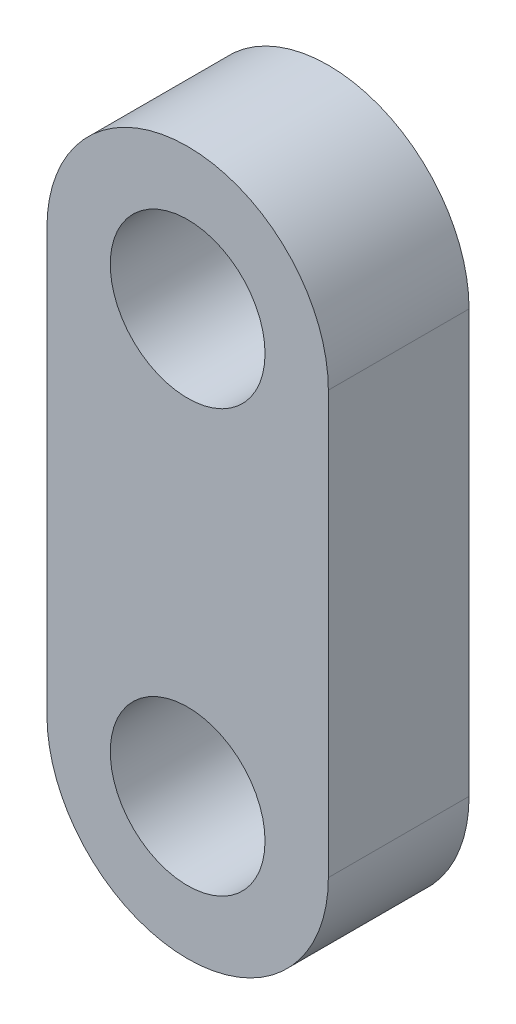
ISO-10303-21;
HEADER;
FILE_DESCRIPTION(('STEP AP214'),'2;1');
FILE_NAME('part.step','',(''),(''),'','','');
FILE_SCHEMA(('AUTOMOTIVE_DESIGN { 1 0 10303 214 1 1 1 1 }'));
ENDSEC;
DATA;
#1=APPLICATION_CONTEXT('core data for automotive mechanical design processes');
#2=APPLICATION_PROTOCOL_DEFINITION('international standard','automotive_design',2000,#1);
#3=PRODUCT_CONTEXT('',#1,'mechanical');
#4=PRODUCT('Part','Part','',(#3));
#5=PRODUCT_RELATED_PRODUCT_CATEGORY('part','',(#4));
#6=PRODUCT_DEFINITION_FORMATION('','',#4);
#7=PRODUCT_DEFINITION_CONTEXT('part definition',#1,'design');
#8=PRODUCT_DEFINITION('design','',#6,#7);
#9=PRODUCT_DEFINITION_SHAPE('','',#8);
#10=(LENGTH_UNIT() NAMED_UNIT(*) SI_UNIT(.MILLI.,.METRE.));
#11=(NAMED_UNIT(*) PLANE_ANGLE_UNIT() SI_UNIT($,.RADIAN.));
#12=(NAMED_UNIT(*) SI_UNIT($,.STERADIAN.) SOLID_ANGLE_UNIT());
#13=UNCERTAINTY_MEASURE_WITH_UNIT(LENGTH_MEASURE(1.E-05),#10,'distance_accuracy_value','');
#14=(GEOMETRIC_REPRESENTATION_CONTEXT(3) GLOBAL_UNCERTAINTY_ASSIGNED_CONTEXT((#13)) GLOBAL_UNIT_ASSIGNED_CONTEXT((#10,
#11,#12)) REPRESENTATION_CONTEXT('',''));
#15=CARTESIAN_POINT('',(0.,0.,0.));
#16=DIRECTION('',(0.,0.,1.));
#17=DIRECTION('',(1.,0.,0.));
#18=AXIS2_PLACEMENT_3D('',#15,#16,#17);
#19=CARTESIAN_POINT('',(0.,7.5,5.));
#20=DIRECTION('',(0.,0.,-1.));
#21=DIRECTION('',(-1.,0.,0.));
#22=AXIS2_PLACEMENT_3D('',#19,#20,#21);
#23=CYLINDRICAL_SURFACE('',#22,5.);
#24=CARTESIAN_POINT('',(0.,7.5,0.));
#25=DIRECTION('',(0.,0.,1.));
#26=DIRECTION('',(1.,0.,0.));
#27=AXIS2_PLACEMENT_3D('',#24,#25,#26);
#28=CIRCLE('',#27,5.);
#29=CARTESIAN_POINT('',(4.99999999999999,7.5,0.));
#30=VERTEX_POINT('',#29);
#31=CARTESIAN_POINT('',(-5.,7.49999999999999,0.));
#32=VERTEX_POINT('',#31);
#33=EDGE_CURVE('E104',#30,#32,#28,.T.);
#34=ORIENTED_EDGE('',*,*,#33,.T.);
#35=DIRECTION('',(0.,0.,-1.));
#36=VECTOR('',#35,1.);
#37=CARTESIAN_POINT('',(-5.,7.49999999999999,5.));
#38=LINE('',#37,#36);
#39=CARTESIAN_POINT('',(-5.,7.49999999999999,5.));
#40=VERTEX_POINT('',#39);
#41=EDGE_CURVE('E11',#40,#32,#38,.T.);
#42=ORIENTED_EDGE('',*,*,#41,.F.);
#43=CARTESIAN_POINT('',(0.,7.5,5.));
#44=DIRECTION('',(0.,0.,1.));
#45=DIRECTION('',(1.,0.,0.));
#46=AXIS2_PLACEMENT_3D('',#43,#44,#45);
#47=CIRCLE('',#46,5.);
#48=CARTESIAN_POINT('',(4.99999999999999,7.5,5.));
#49=VERTEX_POINT('',#48);
#50=EDGE_CURVE('E92',#49,#40,#47,.T.);
#51=ORIENTED_EDGE('',*,*,#50,.F.);
#52=DIRECTION('',(0.,0.,-1.));
#53=VECTOR('',#52,1.);
#54=CARTESIAN_POINT('',(4.99999999999999,7.5,5.));
#55=LINE('',#54,#53);
#56=EDGE_CURVE('E100',#49,#30,#55,.T.);
#57=ORIENTED_EDGE('',*,*,#56,.T.);
#58=EDGE_LOOP('',(#34,#42,#51,#57));
#59=FACE_BOUND('',#58,.T.);
#60=ADVANCED_FACE('F41',(#59),#23,.T.);
#61=CARTESIAN_POINT('',(-5.,7.49999999999999,5.));
#62=DIRECTION('',(1.,0.,0.));
#63=DIRECTION('',(0.,1.,0.));
#64=AXIS2_PLACEMENT_3D('',#61,#62,#63);
#65=PLANE('',#64);
#66=DIRECTION('',(0.,-1.,0.));
#67=VECTOR('',#66,1.);
#68=CARTESIAN_POINT('',(-5.,7.49999999999999,0.));
#69=LINE('',#68,#67);
#70=CARTESIAN_POINT('',(-5.,-7.5,0.));
#71=VERTEX_POINT('',#70);
#72=EDGE_CURVE('E96',#32,#71,#69,.T.);
#73=ORIENTED_EDGE('',*,*,#72,.T.);
#74=DIRECTION('',(0.,0.,-1.));
#75=VECTOR('',#74,1.);
#76=CARTESIAN_POINT('',(-5.,-7.5,5.));
#77=LINE('',#76,#75);
#78=CARTESIAN_POINT('',(-5.,-7.5,5.));
#79=VERTEX_POINT('',#78);
#80=EDGE_CURVE('E49',#79,#71,#77,.T.);
#81=ORIENTED_EDGE('',*,*,#80,.F.);
#82=DIRECTION('',(0.,-1.,0.));
#83=VECTOR('',#82,1.);
#84=CARTESIAN_POINT('',(-5.,7.49999999999999,5.));
#85=LINE('',#84,#83);
#86=EDGE_CURVE('E87',#40,#79,#85,.T.);
#87=ORIENTED_EDGE('',*,*,#86,.F.);
#88=ORIENTED_EDGE('',*,*,#41,.T.);
#89=EDGE_LOOP('',(#73,#81,#87,#88));
#90=FACE_BOUND('',#89,.T.);
#91=ADVANCED_FACE('F95',(#90),#65,.F.);
#92=CARTESIAN_POINT('',(0.,-7.5,5.));
#93=DIRECTION('',(0.,0.,-1.));
#94=DIRECTION('',(-1.,0.,0.));
#95=AXIS2_PLACEMENT_3D('',#92,#93,#94);
#96=CYLINDRICAL_SURFACE('',#95,5.);
#97=CARTESIAN_POINT('',(0.,-7.5,0.));
#98=DIRECTION('',(0.,0.,1.));
#99=DIRECTION('',(1.,0.,0.));
#100=AXIS2_PLACEMENT_3D('',#97,#98,#99);
#101=CIRCLE('',#100,5.);
#102=CARTESIAN_POINT('',(5.,-7.5,0.));
#103=VERTEX_POINT('',#102);
#104=EDGE_CURVE('E74',#71,#103,#101,.T.);
#105=ORIENTED_EDGE('',*,*,#104,.T.);
#106=DIRECTION('',(0.,0.,-1.));
#107=VECTOR('',#106,1.);
#108=CARTESIAN_POINT('',(5.,-7.5,5.));
#109=LINE('',#108,#107);
#110=CARTESIAN_POINT('',(5.,-7.5,5.));
#111=VERTEX_POINT('',#110);
#112=EDGE_CURVE('E97',#111,#103,#109,.T.);
#113=ORIENTED_EDGE('',*,*,#112,.F.);
#114=CARTESIAN_POINT('',(0.,-7.5,5.));
#115=DIRECTION('',(0.,0.,1.));
#116=DIRECTION('',(1.,0.,0.));
#117=AXIS2_PLACEMENT_3D('',#114,#115,#116);
#118=CIRCLE('',#117,5.);
#119=EDGE_CURVE('E90',#79,#111,#118,.T.);
#120=ORIENTED_EDGE('',*,*,#119,.F.);
#121=ORIENTED_EDGE('',*,*,#80,.T.);
#122=EDGE_LOOP('',(#105,#113,#120,#121));
#123=FACE_BOUND('',#122,.T.);
#124=ADVANCED_FACE('F98',(#123),#96,.T.);
#125=CARTESIAN_POINT('',(4.99999999999999,7.5,5.));
#126=DIRECTION('',(-1.,0.,0.));
#127=DIRECTION('',(0.,-1.,0.));
#128=AXIS2_PLACEMENT_3D('',#125,#126,#127);
#129=PLANE('',#128);
#130=DIRECTION('',(0.,1.,0.));
#131=VECTOR('',#130,1.);
#132=CARTESIAN_POINT('',(4.99999999999999,7.5,0.));
#133=LINE('',#132,#131);
#134=EDGE_CURVE('E80',#103,#30,#133,.T.);
#135=ORIENTED_EDGE('',*,*,#134,.T.);
#136=ORIENTED_EDGE('',*,*,#56,.F.);
#137=DIRECTION('',(0.,1.,0.));
#138=VECTOR('',#137,1.);
#139=CARTESIAN_POINT('',(4.99999999999999,7.5,5.));
#140=LINE('',#139,#138);
#141=EDGE_CURVE('E57',#111,#49,#140,.T.);
#142=ORIENTED_EDGE('',*,*,#141,.F.);
#143=ORIENTED_EDGE('',*,*,#112,.T.);
#144=EDGE_LOOP('',(#135,#136,#142,#143));
#145=FACE_BOUND('',#144,.T.);
#146=ADVANCED_FACE('F112',(#145),#129,.F.);
#147=CARTESIAN_POINT('',(0.,7.5,5.));
#148=DIRECTION('',(0.,0.,1.));
#149=DIRECTION('',(1.,0.,0.));
#150=AXIS2_PLACEMENT_3D('',#147,#148,#149);
#151=PLANE('',#150);
#152=CARTESIAN_POINT('',(0.,7.5,5.));
#153=DIRECTION('',(0.,0.,1.));
#154=DIRECTION('',(1.,0.,0.));
#155=AXIS2_PLACEMENT_3D('',#152,#153,#154);
#156=CIRCLE('',#155,2.75);
#157=CARTESIAN_POINT('',(2.75,7.5,5.));
#158=VERTEX_POINT('',#157);
#159=EDGE_CURVE('E126',#158,#158,#156,.T.);
#160=ORIENTED_EDGE('',*,*,#159,.F.);
#161=EDGE_LOOP('',(#160));
#162=FACE_BOUND('',#161,.T.);
#163=CARTESIAN_POINT('',(0.,-7.5,5.));
#164=DIRECTION('',(0.,0.,1.));
#165=DIRECTION('',(1.,0.,0.));
#166=AXIS2_PLACEMENT_3D('',#163,#164,#165);
#167=CIRCLE('',#166,2.75);
#168=CARTESIAN_POINT('',(2.75,-7.5,5.));
#169=VERTEX_POINT('',#168);
#170=EDGE_CURVE('E120',#169,#169,#167,.T.);
#171=ORIENTED_EDGE('',*,*,#170,.F.);
#172=EDGE_LOOP('',(#171));
#173=FACE_BOUND('',#172,.T.);
#174=ORIENTED_EDGE('',*,*,#50,.T.);
#175=ORIENTED_EDGE('',*,*,#86,.T.);
#176=ORIENTED_EDGE('',*,*,#119,.T.);
#177=ORIENTED_EDGE('',*,*,#141,.T.);
#178=EDGE_LOOP('',(#174,#175,#176,#177));
#179=FACE_BOUND('',#178,.T.);
#180=ADVANCED_FACE('F88',(#162,#173,#179),#151,.T.);
#181=CARTESIAN_POINT('',(0.,7.5,0.));
#182=DIRECTION('',(0.,0.,1.));
#183=DIRECTION('',(1.,0.,0.));
#184=AXIS2_PLACEMENT_3D('',#181,#182,#183);
#185=PLANE('',#184);
#186=CARTESIAN_POINT('',(0.,7.5,0.));
#187=DIRECTION('',(0.,0.,1.));
#188=DIRECTION('',(1.,0.,0.));
#189=AXIS2_PLACEMENT_3D('',#186,#187,#188);
#190=CIRCLE('',#189,2.75);
#191=CARTESIAN_POINT('',(2.75,7.5,0.));
#192=VERTEX_POINT('',#191);
#193=EDGE_CURVE('E123',#192,#192,#190,.T.);
#194=ORIENTED_EDGE('',*,*,#193,.T.);
#195=EDGE_LOOP('',(#194));
#196=FACE_BOUND('',#195,.T.);
#197=CARTESIAN_POINT('',(0.,-7.5,0.));
#198=DIRECTION('',(0.,0.,1.));
#199=DIRECTION('',(1.,0.,0.));
#200=AXIS2_PLACEMENT_3D('',#197,#198,#199);
#201=CIRCLE('',#200,2.75);
#202=CARTESIAN_POINT('',(2.75,-7.5,0.));
#203=VERTEX_POINT('',#202);
#204=EDGE_CURVE('E107',#203,#203,#201,.T.);
#205=ORIENTED_EDGE('',*,*,#204,.T.);
#206=EDGE_LOOP('',(#205));
#207=FACE_BOUND('',#206,.T.);
#208=ORIENTED_EDGE('',*,*,#33,.F.);
#209=ORIENTED_EDGE('',*,*,#134,.F.);
#210=ORIENTED_EDGE('',*,*,#104,.F.);
#211=ORIENTED_EDGE('',*,*,#72,.F.);
#212=EDGE_LOOP('',(#208,#209,#210,#211));
#213=FACE_BOUND('',#212,.T.);
#214=ADVANCED_FACE('F115',(#196,#207,#213),#185,.F.);
#215=CARTESIAN_POINT('',(0.,-7.5,5.));
#216=DIRECTION('',(0.,0.,1.));
#217=DIRECTION('',(1.,0.,0.));
#218=AXIS2_PLACEMENT_3D('',#215,#216,#217);
#219=CYLINDRICAL_SURFACE('',#218,2.75);
#220=ORIENTED_EDGE('',*,*,#204,.F.);
#221=EDGE_LOOP('',(#220));
#222=FACE_BOUND('',#221,.T.);
#223=ORIENTED_EDGE('',*,*,#170,.T.);
#224=EDGE_LOOP('',(#223));
#225=FACE_BOUND('',#224,.T.);
#226=ADVANCED_FACE('F137',(#222,#225),#219,.F.);
#227=CARTESIAN_POINT('',(0.,7.5,5.));
#228=DIRECTION('',(0.,0.,1.));
#229=DIRECTION('',(1.,0.,0.));
#230=AXIS2_PLACEMENT_3D('',#227,#228,#229);
#231=CYLINDRICAL_SURFACE('',#230,2.75);
#232=ORIENTED_EDGE('',*,*,#193,.F.);
#233=EDGE_LOOP('',(#232));
#234=FACE_BOUND('',#233,.T.);
#235=ORIENTED_EDGE('',*,*,#159,.T.);
#236=EDGE_LOOP('',(#235));
#237=FACE_BOUND('',#236,.T.);
#238=ADVANCED_FACE('F130',(#234,#237),#231,.F.);
#239=CLOSED_SHELL('',(#60,#91,#124,#146,#180,#214,#226,#238));
#240=MANIFOLD_SOLID_BREP('B2',#239);
#241=ADVANCED_BREP_SHAPE_REPRESENTATION('',(#18,#240),#14);
#242=SHAPE_DEFINITION_REPRESENTATION(#9,#241);
ENDSEC;
END-ISO-10303-21;
